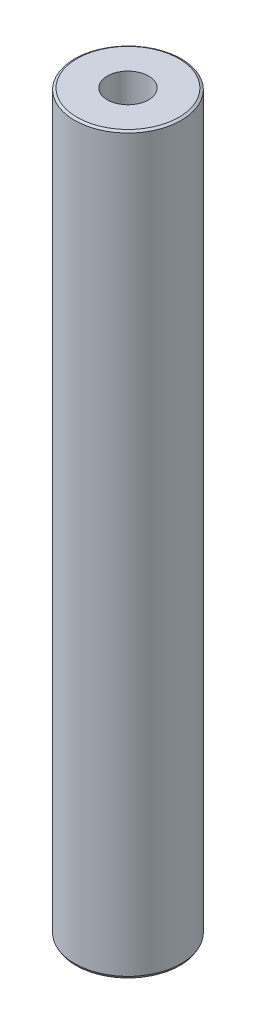
ISO-10303-21;
HEADER;
FILE_DESCRIPTION(('STEP AP214'),'2;1');
FILE_NAME('part.step','',(''),(''),'','','');
FILE_SCHEMA(('AUTOMOTIVE_DESIGN { 1 0 10303 214 1 1 1 1 }'));
ENDSEC;
DATA;
#1=APPLICATION_CONTEXT('core data for automotive mechanical design processes');
#2=APPLICATION_PROTOCOL_DEFINITION('international standard','automotive_design',2000,#1);
#3=PRODUCT_CONTEXT('',#1,'mechanical');
#4=PRODUCT('Part','Part','',(#3));
#5=PRODUCT_RELATED_PRODUCT_CATEGORY('part','',(#4));
#6=PRODUCT_DEFINITION_FORMATION('','',#4);
#7=PRODUCT_DEFINITION_CONTEXT('part definition',#1,'design');
#8=PRODUCT_DEFINITION('design','',#6,#7);
#9=PRODUCT_DEFINITION_SHAPE('','',#8);
#10=(LENGTH_UNIT() NAMED_UNIT(*) SI_UNIT(.MILLI.,.METRE.));
#11=(NAMED_UNIT(*) PLANE_ANGLE_UNIT() SI_UNIT($,.RADIAN.));
#12=(NAMED_UNIT(*) SI_UNIT($,.STERADIAN.) SOLID_ANGLE_UNIT());
#13=UNCERTAINTY_MEASURE_WITH_UNIT(LENGTH_MEASURE(1.E-05),#10,'distance_accuracy_value','');
#14=(GEOMETRIC_REPRESENTATION_CONTEXT(3) GLOBAL_UNCERTAINTY_ASSIGNED_CONTEXT((#13)) GLOBAL_UNIT_ASSIGNED_CONTEXT((#10,
#11,#12)) REPRESENTATION_CONTEXT('',''));
#15=CARTESIAN_POINT('',(0.,0.,0.));
#16=DIRECTION('',(0.,0.,1.));
#17=DIRECTION('',(1.,0.,0.));
#18=AXIS2_PLACEMENT_3D('',#15,#16,#17);
#19=CARTESIAN_POINT('',(0.,309.739403862325,0.));
#20=DIRECTION('',(0.,-1.,0.));
#21=DIRECTION('',(0.,0.,-1.));
#22=AXIS2_PLACEMENT_3D('',#19,#20,#21);
#23=CYLINDRICAL_SURFACE('',#22,22.5);
#24=CARTESIAN_POINT('',(0.,309.149412759349,0.));
#25=DIRECTION('',(0.,1.,0.));
#26=DIRECTION('',(0.,0.,1.));
#27=AXIS2_PLACEMENT_3D('',#24,#25,#26);
#28=CIRCLE('',#27,22.5);
#29=CARTESIAN_POINT('',(0.,309.149412759349,22.5));
#30=VERTEX_POINT('',#29);
#31=EDGE_CURVE('E50',#30,#30,#28,.F.);
#32=ORIENTED_EDGE('',*,*,#31,.T.);
#33=EDGE_LOOP('',(#32));
#34=FACE_BOUND('',#33,.T.);
#35=CARTESIAN_POINT('',(0.,1.02189456636848,0.));
#36=DIRECTION('',(0.,1.,0.));
#37=DIRECTION('',(0.,0.,1.));
#38=AXIS2_PLACEMENT_3D('',#35,#36,#37);
#39=CIRCLE('',#38,22.5);
#40=CARTESIAN_POINT('',(0.,1.02189456636848,22.5));
#41=VERTEX_POINT('',#40);
#42=EDGE_CURVE('E51',#41,#41,#39,.T.);
#43=ORIENTED_EDGE('',*,*,#42,.T.);
#44=EDGE_LOOP('',(#43));
#45=FACE_BOUND('',#44,.T.);
#46=ADVANCED_FACE('F39',(#34,#45),#23,.T.);
#47=CARTESIAN_POINT('',(0.,309.739403862325,0.));
#48=DIRECTION('',(0.,1.,0.));
#49=DIRECTION('',(0.,0.,1.));
#50=AXIS2_PLACEMENT_3D('',#47,#48,#49);
#51=PLANE('',#50);
#52=CARTESIAN_POINT('',(0.,309.739403862325,0.));
#53=DIRECTION('',(0.,1.,0.));
#54=DIRECTION('',(0.,0.,1.));
#55=AXIS2_PLACEMENT_3D('',#52,#53,#54);
#56=CIRCLE('',#55,21.4781054336317);
#57=CARTESIAN_POINT('',(0.,309.739403862325,21.4781054336317));
#58=VERTEX_POINT('',#57);
#59=EDGE_CURVE('E54',#58,#58,#56,.T.);
#60=ORIENTED_EDGE('',*,*,#59,.T.);
#61=EDGE_LOOP('',(#60));
#62=FACE_BOUND('',#61,.T.);
#63=CARTESIAN_POINT('',(0.,309.739403862325,0.));
#64=DIRECTION('',(0.,1.,0.));
#65=DIRECTION('',(0.,0.,1.));
#66=AXIS2_PLACEMENT_3D('',#63,#64,#65);
#67=CIRCLE('',#66,8.71849388452781);
#68=CARTESIAN_POINT('',(0.,309.739403862325,8.71849388452781));
#69=VERTEX_POINT('',#68);
#70=EDGE_CURVE('E58',#69,#69,#67,.T.);
#71=ORIENTED_EDGE('',*,*,#70,.F.);
#72=EDGE_LOOP('',(#71));
#73=FACE_BOUND('',#72,.T.);
#74=ADVANCED_FACE('F69',(#62,#73),#51,.T.);
#75=CARTESIAN_POINT('',(0.,0.,0.));
#76=DIRECTION('',(0.,1.,0.));
#77=DIRECTION('',(0.,0.,1.));
#78=AXIS2_PLACEMENT_3D('',#75,#76,#77);
#79=PLANE('',#78);
#80=CARTESIAN_POINT('',(0.,0.,0.));
#81=DIRECTION('',(0.,1.,0.));
#82=DIRECTION('',(0.,0.,1.));
#83=AXIS2_PLACEMENT_3D('',#80,#81,#82);
#84=CIRCLE('',#83,21.9100088970237);
#85=CARTESIAN_POINT('',(0.,0.,21.9100088970237));
#86=VERTEX_POINT('',#85);
#87=EDGE_CURVE('E10',#86,#86,#84,.F.);
#88=ORIENTED_EDGE('',*,*,#87,.T.);
#89=EDGE_LOOP('',(#88));
#90=FACE_BOUND('',#89,.T.);
#91=CARTESIAN_POINT('',(0.,0.,0.));
#92=DIRECTION('',(0.,1.,0.));
#93=DIRECTION('',(0.,0.,1.));
#94=AXIS2_PLACEMENT_3D('',#91,#92,#93);
#95=CIRCLE('',#94,8.71849388452781);
#96=CARTESIAN_POINT('',(0.,0.,8.71849388452781));
#97=VERTEX_POINT('',#96);
#98=EDGE_CURVE('E63',#97,#97,#95,.T.);
#99=ORIENTED_EDGE('',*,*,#98,.T.);
#100=EDGE_LOOP('',(#99));
#101=FACE_BOUND('',#100,.T.);
#102=ADVANCED_FACE('F75',(#90,#101),#79,.F.);
#103=CARTESIAN_POINT('',(0.,309.739403862325,0.));
#104=DIRECTION('',(0.,-1.,0.));
#105=DIRECTION('',(0.,0.,-1.));
#106=AXIS2_PLACEMENT_3D('',#103,#104,#105);
#107=CYLINDRICAL_SURFACE('',#106,8.71849388452781);
#108=ORIENTED_EDGE('',*,*,#70,.T.);
#109=EDGE_LOOP('',(#108));
#110=FACE_BOUND('',#109,.T.);
#111=ORIENTED_EDGE('',*,*,#98,.F.);
#112=EDGE_LOOP('',(#111));
#113=FACE_BOUND('',#112,.T.);
#114=ADVANCED_FACE('F70',(#110,#113),#107,.F.);
#115=CARTESIAN_POINT('',(0.,309.739403862325,0.));
#116=DIRECTION('',(0.,-1.,0.));
#117=DIRECTION('',(0.,0.,-1.));
#118=AXIS2_PLACEMENT_3D('',#115,#116,#117);
#119=CONICAL_SURFACE('',#118,21.4781054336317,1.04719755119656);
#120=ORIENTED_EDGE('',*,*,#31,.F.);
#121=EDGE_LOOP('',(#120));
#122=FACE_BOUND('',#121,.T.);
#123=ORIENTED_EDGE('',*,*,#59,.F.);
#124=EDGE_LOOP('',(#123));
#125=FACE_BOUND('',#124,.T.);
#126=ADVANCED_FACE('F81',(#122,#125),#119,.T.);
#127=CARTESIAN_POINT('',(0.,1.02189456636848,0.));
#128=DIRECTION('',(0.,1.,0.));
#129=DIRECTION('',(0.,0.,1.));
#130=AXIS2_PLACEMENT_3D('',#127,#128,#129);
#131=CONICAL_SURFACE('',#130,22.5,0.523598775598303);
#132=ORIENTED_EDGE('',*,*,#87,.F.);
#133=EDGE_LOOP('',(#132));
#134=FACE_BOUND('',#133,.T.);
#135=ORIENTED_EDGE('',*,*,#42,.F.);
#136=EDGE_LOOP('',(#135));
#137=FACE_BOUND('',#136,.T.);
#138=ADVANCED_FACE('F45',(#134,#137),#131,.T.);
#139=CLOSED_SHELL('',(#46,#74,#102,#114,#126,#138));
#140=MANIFOLD_SOLID_BREP('B2',#139);
#141=ADVANCED_BREP_SHAPE_REPRESENTATION('',(#18,#140),#14);
#142=SHAPE_DEFINITION_REPRESENTATION(#9,#141);
ENDSEC;
END-ISO-10303-21;
